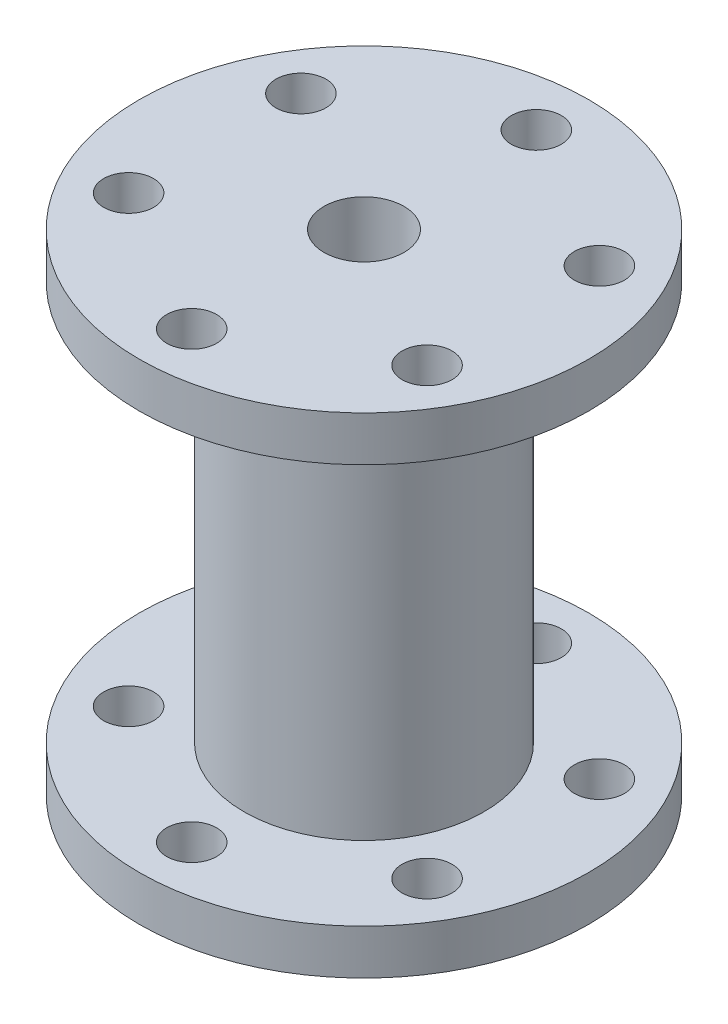
ISO-10303-21;
HEADER;
FILE_DESCRIPTION(('STEP AP214'),'2;1');
FILE_NAME('part.step','',(''),(''),'','','');
FILE_SCHEMA(('AUTOMOTIVE_DESIGN { 1 0 10303 214 1 1 1 1 }'));
ENDSEC;
DATA;
#1=APPLICATION_CONTEXT('core data for automotive mechanical design processes');
#2=APPLICATION_PROTOCOL_DEFINITION('international standard','automotive_design',2000,#1);
#3=PRODUCT_CONTEXT('',#1,'mechanical');
#4=PRODUCT('Part','Part','',(#3));
#5=PRODUCT_RELATED_PRODUCT_CATEGORY('part','',(#4));
#6=PRODUCT_DEFINITION_FORMATION('','',#4);
#7=PRODUCT_DEFINITION_CONTEXT('part definition',#1,'design');
#8=PRODUCT_DEFINITION('design','',#6,#7);
#9=PRODUCT_DEFINITION_SHAPE('','',#8);
#10=(LENGTH_UNIT() NAMED_UNIT(*) SI_UNIT(.MILLI.,.METRE.));
#11=(NAMED_UNIT(*) PLANE_ANGLE_UNIT() SI_UNIT($,.RADIAN.));
#12=(NAMED_UNIT(*) SI_UNIT($,.STERADIAN.) SOLID_ANGLE_UNIT());
#13=UNCERTAINTY_MEASURE_WITH_UNIT(LENGTH_MEASURE(1.E-05),#10,'distance_accuracy_value','');
#14=(GEOMETRIC_REPRESENTATION_CONTEXT(3) GLOBAL_UNCERTAINTY_ASSIGNED_CONTEXT((#13)) GLOBAL_UNIT_ASSIGNED_CONTEXT((#10,
#11,#12)) REPRESENTATION_CONTEXT('',''));
#15=CARTESIAN_POINT('',(0.,0.,0.));
#16=DIRECTION('',(0.,0.,1.));
#17=DIRECTION('',(1.,0.,0.));
#18=AXIS2_PLACEMENT_3D('',#15,#16,#17);
#19=CARTESIAN_POINT('',(0.,4.5,0.));
#20=DIRECTION('',(0.,-1.,0.));
#21=DIRECTION('',(0.,0.,-1.));
#22=AXIS2_PLACEMENT_3D('',#19,#20,#21);
#23=CYLINDRICAL_SURFACE('',#22,22.5);
#24=CARTESIAN_POINT('',(0.,4.5,0.));
#25=DIRECTION('',(0.,1.,0.));
#26=DIRECTION('',(0.,0.,1.));
#27=AXIS2_PLACEMENT_3D('',#24,#25,#26);
#28=CIRCLE('',#27,22.5);
#29=CARTESIAN_POINT('',(0.,4.5,22.5));
#30=VERTEX_POINT('',#29);
#31=EDGE_CURVE('E47',#30,#30,#28,.T.);
#32=ORIENTED_EDGE('',*,*,#31,.F.);
#33=EDGE_LOOP('',(#32));
#34=FACE_BOUND('',#33,.T.);
#35=CARTESIAN_POINT('',(0.,0.,0.));
#36=DIRECTION('',(0.,1.,0.));
#37=DIRECTION('',(0.,0.,1.));
#38=AXIS2_PLACEMENT_3D('',#35,#36,#37);
#39=CIRCLE('',#38,22.5);
#40=CARTESIAN_POINT('',(0.,0.,22.5));
#41=VERTEX_POINT('',#40);
#42=EDGE_CURVE('E53',#41,#41,#39,.T.);
#43=ORIENTED_EDGE('',*,*,#42,.T.);
#44=EDGE_LOOP('',(#43));
#45=FACE_BOUND('',#44,.T.);
#46=ADVANCED_FACE('F39',(#34,#45),#23,.T.);
#47=CARTESIAN_POINT('',(0.,4.5,0.));
#48=DIRECTION('',(0.,1.,0.));
#49=DIRECTION('',(0.,0.,1.));
#50=AXIS2_PLACEMENT_3D('',#47,#48,#49);
#51=PLANE('',#50);
#52=CARTESIAN_POINT('',(0.,4.5,17.25));
#53=DIRECTION('',(0.,1.,0.));
#54=DIRECTION('',(0.,0.,1.));
#55=AXIS2_PLACEMENT_3D('',#52,#53,#54);
#56=CIRCLE('',#55,2.5);
#57=CARTESIAN_POINT('',(0.,4.5,19.75));
#58=VERTEX_POINT('',#57);
#59=EDGE_CURVE('E119',#58,#58,#56,.T.);
#60=ORIENTED_EDGE('',*,*,#59,.F.);
#61=EDGE_LOOP('',(#60));
#62=FACE_BOUND('',#61,.T.);
#63=CARTESIAN_POINT('',(-14.9389382152812,4.5,8.62499999999935));
#64=DIRECTION('',(0.,1.,0.));
#65=DIRECTION('',(0.,0.,1.));
#66=AXIS2_PLACEMENT_3D('',#63,#64,#65);
#67=CIRCLE('',#66,2.50000000000074);
#68=CARTESIAN_POINT('',(-14.9389382152812,4.5,11.1250000000001));
#69=VERTEX_POINT('',#68);
#70=EDGE_CURVE('E101',#69,#69,#67,.T.);
#71=ORIENTED_EDGE('',*,*,#70,.F.);
#72=EDGE_LOOP('',(#71));
#73=FACE_BOUND('',#72,.T.);
#74=CARTESIAN_POINT('',(-14.9389382152805,4.5,-8.62500000000064));
#75=DIRECTION('',(0.,1.,0.));
#76=DIRECTION('',(0.,0.,1.));
#77=AXIS2_PLACEMENT_3D('',#74,#75,#76);
#78=CIRCLE('',#77,2.5000000000014);
#79=CARTESIAN_POINT('',(-14.9389382152805,4.5,-6.12499999999925));
#80=VERTEX_POINT('',#79);
#81=EDGE_CURVE('E95',#80,#80,#78,.T.);
#82=ORIENTED_EDGE('',*,*,#81,.F.);
#83=EDGE_LOOP('',(#82));
#84=FACE_BOUND('',#83,.T.);
#85=CARTESIAN_POINT('',(1.46659843156635E-12,4.5,-17.25));
#86=DIRECTION('',(0.,1.,0.));
#87=DIRECTION('',(0.,0.,1.));
#88=AXIS2_PLACEMENT_3D('',#85,#86,#87);
#89=CIRCLE('',#88,2.50000000000152);
#90=CARTESIAN_POINT('',(1.46659843156635E-12,4.5,-14.7499999999985));
#91=VERTEX_POINT('',#90);
#92=EDGE_CURVE('E90',#91,#91,#89,.T.);
#93=ORIENTED_EDGE('',*,*,#92,.F.);
#94=EDGE_LOOP('',(#93));
#95=FACE_BOUND('',#94,.T.);
#96=CARTESIAN_POINT('',(14.9389382152827,4.5,-8.62499999999936));
#97=DIRECTION('',(0.,1.,0.));
#98=DIRECTION('',(0.,0.,1.));
#99=AXIS2_PLACEMENT_3D('',#96,#97,#98);
#100=CIRCLE('',#99,2.50000000000095);
#101=CARTESIAN_POINT('',(14.9389382152827,4.5,-6.12499999999841));
#102=VERTEX_POINT('',#101);
#103=EDGE_CURVE('E85',#102,#102,#100,.T.);
#104=ORIENTED_EDGE('',*,*,#103,.F.);
#105=EDGE_LOOP('',(#104));
#106=FACE_BOUND('',#105,.T.);
#107=CARTESIAN_POINT('',(14.9389382152819,4.5,8.62500000000064));
#108=DIRECTION('',(0.,1.,0.));
#109=DIRECTION('',(0.,0.,1.));
#110=AXIS2_PLACEMENT_3D('',#107,#108,#109);
#111=CIRCLE('',#110,2.50000000000021);
#112=CARTESIAN_POINT('',(14.9389382152819,4.5,11.1250000000008));
#113=VERTEX_POINT('',#112);
#114=EDGE_CURVE('E79',#113,#113,#111,.T.);
#115=ORIENTED_EDGE('',*,*,#114,.F.);
#116=EDGE_LOOP('',(#115));
#117=FACE_BOUND('',#116,.T.);
#118=CARTESIAN_POINT('',(0.,4.5,0.));
#119=DIRECTION('',(0.,1.,0.));
#120=DIRECTION('',(0.,0.,1.));
#121=AXIS2_PLACEMENT_3D('',#118,#119,#120);
#122=CIRCLE('',#121,12.);
#123=CARTESIAN_POINT('',(0.,4.5,12.));
#124=VERTEX_POINT('',#123);
#125=EDGE_CURVE('E10',#124,#124,#122,.T.);
#126=ORIENTED_EDGE('',*,*,#125,.F.);
#127=EDGE_LOOP('',(#126));
#128=FACE_BOUND('',#127,.T.);
#129=ORIENTED_EDGE('',*,*,#31,.T.);
#130=EDGE_LOOP('',(#129));
#131=FACE_BOUND('',#130,.T.);
#132=ADVANCED_FACE('F153',(#62,#73,#84,#95,#106,#117,#128,#131),#51,.T.);
#133=CARTESIAN_POINT('',(0.,0.,0.));
#134=DIRECTION('',(0.,1.,0.));
#135=DIRECTION('',(0.,0.,1.));
#136=AXIS2_PLACEMENT_3D('',#133,#134,#135);
#137=PLANE('',#136);
#138=CARTESIAN_POINT('',(0.,0.,17.25));
#139=DIRECTION('',(0.,-1.,0.));
#140=DIRECTION('',(0.,0.,-1.));
#141=AXIS2_PLACEMENT_3D('',#138,#139,#140);
#142=CIRCLE('',#141,2.5);
#143=CARTESIAN_POINT('',(0.,0.,14.75));
#144=VERTEX_POINT('',#143);
#145=EDGE_CURVE('E73',#144,#144,#142,.T.);
#146=ORIENTED_EDGE('',*,*,#145,.F.);
#147=EDGE_LOOP('',(#146));
#148=FACE_BOUND('',#147,.T.);
#149=CARTESIAN_POINT('',(-14.9389382152812,0.,8.62499999999935));
#150=DIRECTION('',(0.,-1.,0.));
#151=DIRECTION('',(0.,0.,-1.));
#152=AXIS2_PLACEMENT_3D('',#149,#150,#151);
#153=CIRCLE('',#152,2.50000000000074);
#154=CARTESIAN_POINT('',(-14.9389382152812,0.,6.12499999999861));
#155=VERTEX_POINT('',#154);
#156=EDGE_CURVE('E323',#155,#155,#153,.T.);
#157=ORIENTED_EDGE('',*,*,#156,.F.);
#158=EDGE_LOOP('',(#157));
#159=FACE_BOUND('',#158,.T.);
#160=CARTESIAN_POINT('',(-14.9389382152805,0.,-8.62500000000064));
#161=DIRECTION('',(0.,-1.,0.));
#162=DIRECTION('',(0.,0.,-1.));
#163=AXIS2_PLACEMENT_3D('',#160,#161,#162);
#164=CIRCLE('',#163,2.5000000000014);
#165=CARTESIAN_POINT('',(-14.9389382152805,0.,-11.125000000002));
#166=VERTEX_POINT('',#165);
#167=EDGE_CURVE('E326',#166,#166,#164,.T.);
#168=ORIENTED_EDGE('',*,*,#167,.F.);
#169=EDGE_LOOP('',(#168));
#170=FACE_BOUND('',#169,.T.);
#171=CARTESIAN_POINT('',(1.46659843156635E-12,0.,-17.25));
#172=DIRECTION('',(0.,-1.,0.));
#173=DIRECTION('',(0.,0.,-1.));
#174=AXIS2_PLACEMENT_3D('',#171,#172,#173);
#175=CIRCLE('',#174,2.50000000000152);
#176=CARTESIAN_POINT('',(1.46659843156635E-12,0.,-19.7500000000015));
#177=VERTEX_POINT('',#176);
#178=EDGE_CURVE('E331',#177,#177,#175,.T.);
#179=ORIENTED_EDGE('',*,*,#178,.F.);
#180=EDGE_LOOP('',(#179));
#181=FACE_BOUND('',#180,.T.);
#182=CARTESIAN_POINT('',(14.9389382152827,0.,-8.62499999999936));
#183=DIRECTION('',(0.,-1.,0.));
#184=DIRECTION('',(0.,0.,-1.));
#185=AXIS2_PLACEMENT_3D('',#182,#183,#184);
#186=CIRCLE('',#185,2.50000000000095);
#187=CARTESIAN_POINT('',(14.9389382152827,0.,-11.1250000000003));
#188=VERTEX_POINT('',#187);
#189=EDGE_CURVE('E320',#188,#188,#186,.T.);
#190=ORIENTED_EDGE('',*,*,#189,.F.);
#191=EDGE_LOOP('',(#190));
#192=FACE_BOUND('',#191,.T.);
#193=CARTESIAN_POINT('',(14.9389382152819,0.,8.62500000000064));
#194=DIRECTION('',(0.,-1.,0.));
#195=DIRECTION('',(0.,0.,-1.));
#196=AXIS2_PLACEMENT_3D('',#193,#194,#195);
#197=CIRCLE('',#196,2.50000000000021);
#198=CARTESIAN_POINT('',(14.9389382152819,0.,6.12500000000043));
#199=VERTEX_POINT('',#198);
#200=EDGE_CURVE('E316',#199,#199,#197,.T.);
#201=ORIENTED_EDGE('',*,*,#200,.F.);
#202=EDGE_LOOP('',(#201));
#203=FACE_BOUND('',#202,.T.);
#204=CARTESIAN_POINT('',(0.,0.,0.));
#205=DIRECTION('',(0.,-1.,0.));
#206=DIRECTION('',(0.,0.,-1.));
#207=AXIS2_PLACEMENT_3D('',#204,#205,#206);
#208=CIRCLE('',#207,4.);
#209=CARTESIAN_POINT('',(0.,0.,-4.));
#210=VERTEX_POINT('',#209);
#211=EDGE_CURVE('E67',#210,#210,#208,.T.);
#212=ORIENTED_EDGE('',*,*,#211,.F.);
#213=EDGE_LOOP('',(#212));
#214=FACE_BOUND('',#213,.T.);
#215=ORIENTED_EDGE('',*,*,#42,.F.);
#216=EDGE_LOOP('',(#215));
#217=FACE_BOUND('',#216,.T.);
#218=ADVANCED_FACE('F158',(#148,#159,#170,#181,#192,#203,#214,#217),#137,.F.);
#219=CARTESIAN_POINT('',(0.,44.5,0.));
#220=DIRECTION('',(0.,-1.,0.));
#221=DIRECTION('',(0.,0.,-1.));
#222=AXIS2_PLACEMENT_3D('',#219,#220,#221);
#223=CYLINDRICAL_SURFACE('',#222,12.);
#224=CARTESIAN_POINT('',(0.,44.5,0.));
#225=DIRECTION('',(0.,1.,0.));
#226=DIRECTION('',(0.,0.,1.));
#227=AXIS2_PLACEMENT_3D('',#224,#225,#226);
#228=CIRCLE('',#227,12.);
#229=CARTESIAN_POINT('',(0.,44.5,12.));
#230=VERTEX_POINT('',#229);
#231=EDGE_CURVE('E56',#230,#230,#228,.T.);
#232=ORIENTED_EDGE('',*,*,#231,.F.);
#233=EDGE_LOOP('',(#232));
#234=FACE_BOUND('',#233,.T.);
#235=ORIENTED_EDGE('',*,*,#125,.T.);
#236=EDGE_LOOP('',(#235));
#237=FACE_BOUND('',#236,.T.);
#238=ADVANCED_FACE('F166',(#234,#237),#223,.T.);
#239=CARTESIAN_POINT('',(0.,49.,0.));
#240=DIRECTION('',(0.,-1.,0.));
#241=DIRECTION('',(0.,0.,-1.));
#242=AXIS2_PLACEMENT_3D('',#239,#240,#241);
#243=CYLINDRICAL_SURFACE('',#242,22.5);
#244=CARTESIAN_POINT('',(0.,49.,0.));
#245=DIRECTION('',(0.,1.,0.));
#246=DIRECTION('',(0.,0.,1.));
#247=AXIS2_PLACEMENT_3D('',#244,#245,#246);
#248=CIRCLE('',#247,22.5);
#249=CARTESIAN_POINT('',(0.,49.,22.5));
#250=VERTEX_POINT('',#249);
#251=EDGE_CURVE('E126',#250,#250,#248,.T.);
#252=ORIENTED_EDGE('',*,*,#251,.F.);
#253=EDGE_LOOP('',(#252));
#254=FACE_BOUND('',#253,.T.);
#255=CARTESIAN_POINT('',(0.,44.5,0.));
#256=DIRECTION('',(0.,1.,0.));
#257=DIRECTION('',(0.,0.,1.));
#258=AXIS2_PLACEMENT_3D('',#255,#256,#257);
#259=CIRCLE('',#258,22.5);
#260=CARTESIAN_POINT('',(0.,44.5,22.5));
#261=VERTEX_POINT('',#260);
#262=EDGE_CURVE('E66',#261,#261,#259,.T.);
#263=ORIENTED_EDGE('',*,*,#262,.T.);
#264=EDGE_LOOP('',(#263));
#265=FACE_BOUND('',#264,.T.);
#266=ADVANCED_FACE('F133',(#254,#265),#243,.T.);
#267=CARTESIAN_POINT('',(0.,49.,0.));
#268=DIRECTION('',(0.,1.,0.));
#269=DIRECTION('',(0.,0.,1.));
#270=AXIS2_PLACEMENT_3D('',#267,#268,#269);
#271=PLANE('',#270);
#272=CARTESIAN_POINT('',(0.,49.,17.25));
#273=DIRECTION('',(0.,1.,0.));
#274=DIRECTION('',(0.,0.,1.));
#275=AXIS2_PLACEMENT_3D('',#272,#273,#274);
#276=CIRCLE('',#275,2.5);
#277=CARTESIAN_POINT('',(0.,49.,19.75));
#278=VERTEX_POINT('',#277);
#279=EDGE_CURVE('E115',#278,#278,#276,.T.);
#280=ORIENTED_EDGE('',*,*,#279,.F.);
#281=EDGE_LOOP('',(#280));
#282=FACE_BOUND('',#281,.T.);
#283=CARTESIAN_POINT('',(-14.9389382152812,49.,8.62499999999935));
#284=DIRECTION('',(0.,1.,0.));
#285=DIRECTION('',(0.,0.,1.));
#286=AXIS2_PLACEMENT_3D('',#283,#284,#285);
#287=CIRCLE('',#286,2.50000000000074);
#288=CARTESIAN_POINT('',(-14.9389382152812,49.,11.1250000000001));
#289=VERTEX_POINT('',#288);
#290=EDGE_CURVE('E94',#289,#289,#287,.T.);
#291=ORIENTED_EDGE('',*,*,#290,.F.);
#292=EDGE_LOOP('',(#291));
#293=FACE_BOUND('',#292,.T.);
#294=CARTESIAN_POINT('',(-14.9389382152805,49.,-8.62500000000064));
#295=DIRECTION('',(0.,1.,0.));
#296=DIRECTION('',(0.,0.,1.));
#297=AXIS2_PLACEMENT_3D('',#294,#295,#296);
#298=CIRCLE('',#297,2.5000000000014);
#299=CARTESIAN_POINT('',(-14.9389382152805,49.,-6.12499999999925));
#300=VERTEX_POINT('',#299);
#301=EDGE_CURVE('E89',#300,#300,#298,.T.);
#302=ORIENTED_EDGE('',*,*,#301,.F.);
#303=EDGE_LOOP('',(#302));
#304=FACE_BOUND('',#303,.T.);
#305=CARTESIAN_POINT('',(1.46659843156635E-12,49.,-17.25));
#306=DIRECTION('',(0.,1.,0.));
#307=DIRECTION('',(0.,0.,1.));
#308=AXIS2_PLACEMENT_3D('',#305,#306,#307);
#309=CIRCLE('',#308,2.50000000000152);
#310=CARTESIAN_POINT('',(1.46659843156635E-12,49.,-14.7499999999985));
#311=VERTEX_POINT('',#310);
#312=EDGE_CURVE('E84',#311,#311,#309,.T.);
#313=ORIENTED_EDGE('',*,*,#312,.F.);
#314=EDGE_LOOP('',(#313));
#315=FACE_BOUND('',#314,.T.);
#316=CARTESIAN_POINT('',(14.9389382152827,49.,-8.62499999999936));
#317=DIRECTION('',(0.,1.,0.));
#318=DIRECTION('',(0.,0.,1.));
#319=AXIS2_PLACEMENT_3D('',#316,#317,#318);
#320=CIRCLE('',#319,2.50000000000095);
#321=CARTESIAN_POINT('',(14.9389382152827,49.,-6.12499999999841));
#322=VERTEX_POINT('',#321);
#323=EDGE_CURVE('E78',#322,#322,#320,.T.);
#324=ORIENTED_EDGE('',*,*,#323,.F.);
#325=EDGE_LOOP('',(#324));
#326=FACE_BOUND('',#325,.T.);
#327=CARTESIAN_POINT('',(14.9389382152819,49.,8.62500000000064));
#328=DIRECTION('',(0.,1.,0.));
#329=DIRECTION('',(0.,0.,1.));
#330=AXIS2_PLACEMENT_3D('',#327,#328,#329);
#331=CIRCLE('',#330,2.50000000000021);
#332=CARTESIAN_POINT('',(14.9389382152819,49.,11.1250000000008));
#333=VERTEX_POINT('',#332);
#334=EDGE_CURVE('E72',#333,#333,#331,.T.);
#335=ORIENTED_EDGE('',*,*,#334,.F.);
#336=EDGE_LOOP('',(#335));
#337=FACE_BOUND('',#336,.T.);
#338=CARTESIAN_POINT('',(0.,49.,0.));
#339=DIRECTION('',(0.,1.,0.));
#340=DIRECTION('',(0.,0.,1.));
#341=AXIS2_PLACEMENT_3D('',#338,#339,#340);
#342=CIRCLE('',#341,4.);
#343=CARTESIAN_POINT('',(0.,49.,4.));
#344=VERTEX_POINT('',#343);
#345=EDGE_CURVE('E62',#344,#344,#342,.T.);
#346=ORIENTED_EDGE('',*,*,#345,.F.);
#347=EDGE_LOOP('',(#346));
#348=FACE_BOUND('',#347,.T.);
#349=ORIENTED_EDGE('',*,*,#251,.T.);
#350=EDGE_LOOP('',(#349));
#351=FACE_BOUND('',#350,.T.);
#352=ADVANCED_FACE('F138',(#282,#293,#304,#315,#326,#337,#348,#351),#271,.T.);
#353=CARTESIAN_POINT('',(0.,44.5,0.));
#354=DIRECTION('',(0.,1.,0.));
#355=DIRECTION('',(0.,0.,1.));
#356=AXIS2_PLACEMENT_3D('',#353,#354,#355);
#357=PLANE('',#356);
#358=CARTESIAN_POINT('',(0.,44.5,17.25));
#359=DIRECTION('',(0.,1.,0.));
#360=DIRECTION('',(0.,0.,1.));
#361=AXIS2_PLACEMENT_3D('',#358,#359,#360);
#362=CIRCLE('',#361,2.5);
#363=CARTESIAN_POINT('',(0.,44.5,19.75));
#364=VERTEX_POINT('',#363);
#365=EDGE_CURVE('E42',#364,#364,#362,.T.);
#366=ORIENTED_EDGE('',*,*,#365,.T.);
#367=EDGE_LOOP('',(#366));
#368=FACE_BOUND('',#367,.T.);
#369=CARTESIAN_POINT('',(-14.9389382152812,44.5,8.62499999999935));
#370=DIRECTION('',(0.,1.,0.));
#371=DIRECTION('',(0.,0.,1.));
#372=AXIS2_PLACEMENT_3D('',#369,#370,#371);
#373=CIRCLE('',#372,2.50000000000074);
#374=CARTESIAN_POINT('',(-14.9389382152812,44.5,11.1250000000001));
#375=VERTEX_POINT('',#374);
#376=EDGE_CURVE('E91',#375,#375,#373,.T.);
#377=ORIENTED_EDGE('',*,*,#376,.T.);
#378=EDGE_LOOP('',(#377));
#379=FACE_BOUND('',#378,.T.);
#380=CARTESIAN_POINT('',(-14.9389382152805,44.5,-8.62500000000064));
#381=DIRECTION('',(0.,1.,0.));
#382=DIRECTION('',(0.,0.,1.));
#383=AXIS2_PLACEMENT_3D('',#380,#381,#382);
#384=CIRCLE('',#383,2.5000000000014);
#385=CARTESIAN_POINT('',(-14.9389382152805,44.5,-6.12499999999925));
#386=VERTEX_POINT('',#385);
#387=EDGE_CURVE('E86',#386,#386,#384,.T.);
#388=ORIENTED_EDGE('',*,*,#387,.T.);
#389=EDGE_LOOP('',(#388));
#390=FACE_BOUND('',#389,.T.);
#391=CARTESIAN_POINT('',(1.46659843156635E-12,44.5,-17.25));
#392=DIRECTION('',(0.,1.,0.));
#393=DIRECTION('',(0.,0.,1.));
#394=AXIS2_PLACEMENT_3D('',#391,#392,#393);
#395=CIRCLE('',#394,2.50000000000152);
#396=CARTESIAN_POINT('',(1.46659843156635E-12,44.5,-14.7499999999985));
#397=VERTEX_POINT('',#396);
#398=EDGE_CURVE('E80',#397,#397,#395,.T.);
#399=ORIENTED_EDGE('',*,*,#398,.T.);
#400=EDGE_LOOP('',(#399));
#401=FACE_BOUND('',#400,.T.);
#402=CARTESIAN_POINT('',(14.9389382152827,44.5,-8.62499999999936));
#403=DIRECTION('',(0.,1.,0.));
#404=DIRECTION('',(0.,0.,1.));
#405=AXIS2_PLACEMENT_3D('',#402,#403,#404);
#406=CIRCLE('',#405,2.50000000000095);
#407=CARTESIAN_POINT('',(14.9389382152827,44.5,-6.12499999999841));
#408=VERTEX_POINT('',#407);
#409=EDGE_CURVE('E74',#408,#408,#406,.T.);
#410=ORIENTED_EDGE('',*,*,#409,.T.);
#411=EDGE_LOOP('',(#410));
#412=FACE_BOUND('',#411,.T.);
#413=CARTESIAN_POINT('',(14.9389382152819,44.5,8.62500000000064));
#414=DIRECTION('',(0.,1.,0.));
#415=DIRECTION('',(0.,0.,1.));
#416=AXIS2_PLACEMENT_3D('',#413,#414,#415);
#417=CIRCLE('',#416,2.50000000000021);
#418=CARTESIAN_POINT('',(14.9389382152819,44.5,11.1250000000008));
#419=VERTEX_POINT('',#418);
#420=EDGE_CURVE('E68',#419,#419,#417,.T.);
#421=ORIENTED_EDGE('',*,*,#420,.T.);
#422=EDGE_LOOP('',(#421));
#423=FACE_BOUND('',#422,.T.);
#424=ORIENTED_EDGE('',*,*,#231,.T.);
#425=EDGE_LOOP('',(#424));
#426=FACE_BOUND('',#425,.T.);
#427=ORIENTED_EDGE('',*,*,#262,.F.);
#428=EDGE_LOOP('',(#427));
#429=FACE_BOUND('',#428,.T.);
#430=ADVANCED_FACE('F135',(#368,#379,#390,#401,#412,#423,#426,#429),#357,.F.);
#431=CARTESIAN_POINT('',(0.,60.5,0.));
#432=DIRECTION('',(0.,-1.,0.));
#433=DIRECTION('',(0.,0.,-1.));
#434=AXIS2_PLACEMENT_3D('',#431,#432,#433);
#435=CYLINDRICAL_SURFACE('',#434,4.);
#436=ORIENTED_EDGE('',*,*,#345,.T.);
#437=EDGE_LOOP('',(#436));
#438=FACE_BOUND('',#437,.T.);
#439=ORIENTED_EDGE('',*,*,#211,.T.);
#440=EDGE_LOOP('',(#439));
#441=FACE_BOUND('',#440,.T.);
#442=ADVANCED_FACE('F137',(#438,#441),#435,.F.);
#443=CARTESIAN_POINT('',(14.9389382152819,60.5,8.62500000000064));
#444=DIRECTION('',(0.,-1.,0.));
#445=DIRECTION('',(0.,0.,-1.));
#446=AXIS2_PLACEMENT_3D('',#443,#444,#445);
#447=CYLINDRICAL_SURFACE('',#446,2.50000000000021);
#448=ORIENTED_EDGE('',*,*,#334,.T.);
#449=EDGE_LOOP('',(#448));
#450=FACE_BOUND('',#449,.T.);
#451=ORIENTED_EDGE('',*,*,#420,.F.);
#452=EDGE_LOOP('',(#451));
#453=FACE_BOUND('',#452,.T.);
#454=ADVANCED_FACE('F145',(#450,#453),#447,.F.);
#455=CARTESIAN_POINT('',(14.9389382152827,60.5,-8.62499999999936));
#456=DIRECTION('',(0.,-1.,0.));
#457=DIRECTION('',(0.,0.,-1.));
#458=AXIS2_PLACEMENT_3D('',#455,#456,#457);
#459=CYLINDRICAL_SURFACE('',#458,2.50000000000095);
#460=ORIENTED_EDGE('',*,*,#323,.T.);
#461=EDGE_LOOP('',(#460));
#462=FACE_BOUND('',#461,.T.);
#463=ORIENTED_EDGE('',*,*,#409,.F.);
#464=EDGE_LOOP('',(#463));
#465=FACE_BOUND('',#464,.T.);
#466=ADVANCED_FACE('F205',(#462,#465),#459,.F.);
#467=CARTESIAN_POINT('',(1.46659843156635E-12,60.5,-17.25));
#468=DIRECTION('',(0.,-1.,0.));
#469=DIRECTION('',(0.,0.,-1.));
#470=AXIS2_PLACEMENT_3D('',#467,#468,#469);
#471=CYLINDRICAL_SURFACE('',#470,2.50000000000152);
#472=ORIENTED_EDGE('',*,*,#312,.T.);
#473=EDGE_LOOP('',(#472));
#474=FACE_BOUND('',#473,.T.);
#475=ORIENTED_EDGE('',*,*,#398,.F.);
#476=EDGE_LOOP('',(#475));
#477=FACE_BOUND('',#476,.T.);
#478=ADVANCED_FACE('F216',(#474,#477),#471,.F.);
#479=CARTESIAN_POINT('',(-14.9389382152805,60.5,-8.62500000000064));
#480=DIRECTION('',(0.,-1.,0.));
#481=DIRECTION('',(0.,0.,-1.));
#482=AXIS2_PLACEMENT_3D('',#479,#480,#481);
#483=CYLINDRICAL_SURFACE('',#482,2.5000000000014);
#484=ORIENTED_EDGE('',*,*,#301,.T.);
#485=EDGE_LOOP('',(#484));
#486=FACE_BOUND('',#485,.T.);
#487=ORIENTED_EDGE('',*,*,#387,.F.);
#488=EDGE_LOOP('',(#487));
#489=FACE_BOUND('',#488,.T.);
#490=ADVANCED_FACE('F227',(#486,#489),#483,.F.);
#491=CARTESIAN_POINT('',(-14.9389382152812,60.5,8.62499999999935));
#492=DIRECTION('',(0.,-1.,0.));
#493=DIRECTION('',(0.,0.,-1.));
#494=AXIS2_PLACEMENT_3D('',#491,#492,#493);
#495=CYLINDRICAL_SURFACE('',#494,2.50000000000074);
#496=ORIENTED_EDGE('',*,*,#290,.T.);
#497=EDGE_LOOP('',(#496));
#498=FACE_BOUND('',#497,.T.);
#499=ORIENTED_EDGE('',*,*,#376,.F.);
#500=EDGE_LOOP('',(#499));
#501=FACE_BOUND('',#500,.T.);
#502=ADVANCED_FACE('F238',(#498,#501),#495,.F.);
#503=CARTESIAN_POINT('',(0.,60.5,17.25));
#504=DIRECTION('',(0.,-1.,0.));
#505=DIRECTION('',(0.,0.,-1.));
#506=AXIS2_PLACEMENT_3D('',#503,#504,#505);
#507=CYLINDRICAL_SURFACE('',#506,2.5);
#508=ORIENTED_EDGE('',*,*,#279,.T.);
#509=EDGE_LOOP('',(#508));
#510=FACE_BOUND('',#509,.T.);
#511=ORIENTED_EDGE('',*,*,#365,.F.);
#512=EDGE_LOOP('',(#511));
#513=FACE_BOUND('',#512,.T.);
#514=ADVANCED_FACE('F249',(#510,#513),#507,.F.);
#515=ORIENTED_EDGE('',*,*,#114,.T.);
#516=EDGE_LOOP('',(#515));
#517=FACE_BOUND('',#516,.T.);
#518=ORIENTED_EDGE('',*,*,#200,.T.);
#519=EDGE_LOOP('',(#518));
#520=FACE_BOUND('',#519,.T.);
#521=ADVANCED_FACE('F208',(#517,#520),#447,.F.);
#522=ORIENTED_EDGE('',*,*,#103,.T.);
#523=EDGE_LOOP('',(#522));
#524=FACE_BOUND('',#523,.T.);
#525=ORIENTED_EDGE('',*,*,#189,.T.);
#526=EDGE_LOOP('',(#525));
#527=FACE_BOUND('',#526,.T.);
#528=ADVANCED_FACE('F219',(#524,#527),#459,.F.);
#529=ORIENTED_EDGE('',*,*,#92,.T.);
#530=EDGE_LOOP('',(#529));
#531=FACE_BOUND('',#530,.T.);
#532=ORIENTED_EDGE('',*,*,#178,.T.);
#533=EDGE_LOOP('',(#532));
#534=FACE_BOUND('',#533,.T.);
#535=ADVANCED_FACE('F230',(#531,#534),#471,.F.);
#536=ORIENTED_EDGE('',*,*,#81,.T.);
#537=EDGE_LOOP('',(#536));
#538=FACE_BOUND('',#537,.T.);
#539=ORIENTED_EDGE('',*,*,#167,.T.);
#540=EDGE_LOOP('',(#539));
#541=FACE_BOUND('',#540,.T.);
#542=ADVANCED_FACE('F241',(#538,#541),#483,.F.);
#543=ORIENTED_EDGE('',*,*,#70,.T.);
#544=EDGE_LOOP('',(#543));
#545=FACE_BOUND('',#544,.T.);
#546=ORIENTED_EDGE('',*,*,#156,.T.);
#547=EDGE_LOOP('',(#546));
#548=FACE_BOUND('',#547,.T.);
#549=ADVANCED_FACE('F252',(#545,#548),#495,.F.);
#550=ORIENTED_EDGE('',*,*,#59,.T.);
#551=EDGE_LOOP('',(#550));
#552=FACE_BOUND('',#551,.T.);
#553=ORIENTED_EDGE('',*,*,#145,.T.);
#554=EDGE_LOOP('',(#553));
#555=FACE_BOUND('',#554,.T.);
#556=ADVANCED_FACE('F262',(#552,#555),#507,.F.);
#557=CLOSED_SHELL('',(#46,#132,#218,#238,#266,#352,#430,#442,#454,#466,#478,#490,#502,#514,#521,
#528,#535,#542,#549,#556));
#558=MANIFOLD_SOLID_BREP('B2',#557);
#559=ADVANCED_BREP_SHAPE_REPRESENTATION('',(#18,#558),#14);
#560=SHAPE_DEFINITION_REPRESENTATION(#9,#559);
ENDSEC;
END-ISO-10303-21;
